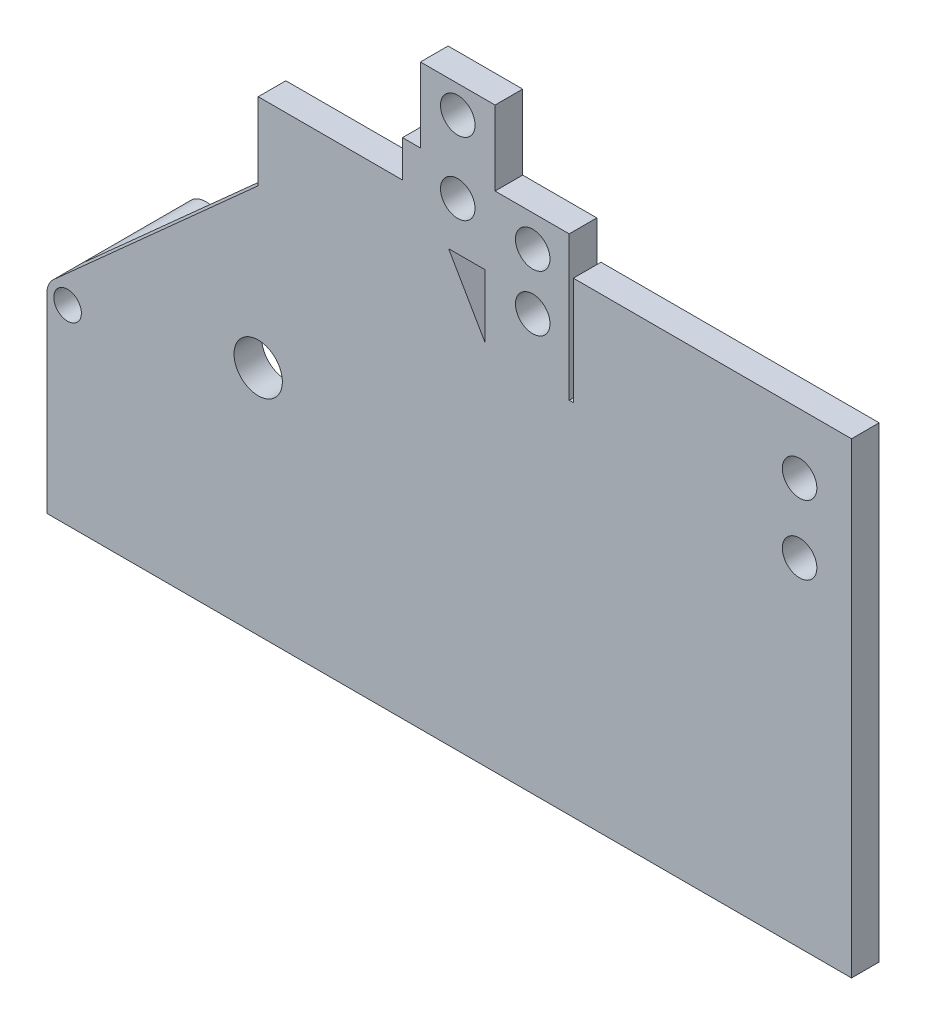
ISO-10303-21;
HEADER;
FILE_DESCRIPTION(('STEP AP214'),'2;1');
FILE_NAME('part.step','',(''),(''),'','','');
FILE_SCHEMA(('AUTOMOTIVE_DESIGN { 1 0 10303 214 1 1 1 1 }'));
ENDSEC;
DATA;
#1=APPLICATION_CONTEXT('core data for automotive mechanical design processes');
#2=APPLICATION_PROTOCOL_DEFINITION('international standard','automotive_design',2000,#1);
#3=PRODUCT_CONTEXT('',#1,'mechanical');
#4=PRODUCT('Part','Part','',(#3));
#5=PRODUCT_RELATED_PRODUCT_CATEGORY('part','',(#4));
#6=PRODUCT_DEFINITION_FORMATION('','',#4);
#7=PRODUCT_DEFINITION_CONTEXT('part definition',#1,'design');
#8=PRODUCT_DEFINITION('design','',#6,#7);
#9=PRODUCT_DEFINITION_SHAPE('','',#8);
#10=(LENGTH_UNIT() NAMED_UNIT(*) SI_UNIT(.MILLI.,.METRE.));
#11=(NAMED_UNIT(*) PLANE_ANGLE_UNIT() SI_UNIT($,.RADIAN.));
#12=(NAMED_UNIT(*) SI_UNIT($,.STERADIAN.) SOLID_ANGLE_UNIT());
#13=UNCERTAINTY_MEASURE_WITH_UNIT(LENGTH_MEASURE(1.E-05),#10,'distance_accuracy_value','');
#14=(GEOMETRIC_REPRESENTATION_CONTEXT(3) GLOBAL_UNCERTAINTY_ASSIGNED_CONTEXT((#13)) GLOBAL_UNIT_ASSIGNED_CONTEXT((#10,
#11,#12)) REPRESENTATION_CONTEXT('',''));
#15=CARTESIAN_POINT('',(0.,0.,0.));
#16=DIRECTION('',(0.,0.,1.));
#17=DIRECTION('',(1.,0.,0.));
#18=AXIS2_PLACEMENT_3D('',#15,#16,#17);
#19=CARTESIAN_POINT('',(0.,311.384042750519,0.));
#20=DIRECTION('',(0.,1.,0.));
#21=DIRECTION('',(0.,0.,1.));
#22=AXIS2_PLACEMENT_3D('',#19,#20,#21);
#23=PLANE('',#22);
#24=DIRECTION('',(0.,0.,1.));
#25=VECTOR('',#24,1.);
#26=CARTESIAN_POINT('',(290.842773547687,311.384042750519,0.));
#27=LINE('',#26,#25);
#28=CARTESIAN_POINT('',(290.842773547687,311.384042750519,0.));
#29=VERTEX_POINT('',#28);
#30=CARTESIAN_POINT('',(290.842773547687,311.384042750519,20.));
#31=VERTEX_POINT('',#30);
#32=EDGE_CURVE('E132',#29,#31,#27,.T.);
#33=ORIENTED_EDGE('',*,*,#32,.F.);
#34=DIRECTION('',(-1.,0.,0.));
#35=VECTOR('',#34,1.);
#36=CARTESIAN_POINT('',(0.,311.384042750519,0.));
#37=LINE('',#36,#35);
#38=CARTESIAN_POINT('',(317.180522157063,311.384042750519,0.));
#39=VERTEX_POINT('',#38);
#40=EDGE_CURVE('E349',#39,#29,#37,.T.);
#41=ORIENTED_EDGE('',*,*,#40,.F.);
#42=DIRECTION('',(0.,0.,1.));
#43=VECTOR('',#42,1.);
#44=CARTESIAN_POINT('',(317.180522157063,311.384042750519,0.));
#45=LINE('',#44,#43);
#46=CARTESIAN_POINT('',(317.180522157063,311.384042750519,20.));
#47=VERTEX_POINT('',#46);
#48=EDGE_CURVE('E116',#39,#47,#45,.T.);
#49=ORIENTED_EDGE('',*,*,#48,.T.);
#50=DIRECTION('',(-1.,0.,0.));
#51=VECTOR('',#50,1.);
#52=CARTESIAN_POINT('',(0.,311.384042750519,20.));
#53=LINE('',#52,#51);
#54=EDGE_CURVE('E382',#47,#31,#53,.T.);
#55=ORIENTED_EDGE('',*,*,#54,.T.);
#56=EDGE_LOOP('',(#33,#41,#49,#55));
#57=FACE_BOUND('',#56,.T.);
#58=ADVANCED_FACE('F107',(#57),#23,.F.);
#59=CARTESIAN_POINT('',(257.46049576549,0.,0.));
#60=DIRECTION('',(-1.,0.,0.));
#61=DIRECTION('',(0.,0.,1.));
#62=AXIS2_PLACEMENT_3D('',#59,#60,#61);
#63=PLANE('',#62);
#64=DIRECTION('',(0.,-1.,0.));
#65=VECTOR('',#64,1.);
#66=CARTESIAN_POINT('',(257.46049576549,0.,0.));
#67=LINE('',#66,#65);
#68=CARTESIAN_POINT('',(257.46049576549,364.320187298071,0.));
#69=VERTEX_POINT('',#68);
#70=CARTESIAN_POINT('',(257.46049576549,337.740187298071,0.));
#71=VERTEX_POINT('',#70);
#72=EDGE_CURVE('E124',#69,#71,#67,.T.);
#73=ORIENTED_EDGE('',*,*,#72,.T.);
#74=DIRECTION('',(0.,0.,1.));
#75=VECTOR('',#74,1.);
#76=CARTESIAN_POINT('',(257.46049576549,337.740187298071,0.));
#77=LINE('',#76,#75);
#78=CARTESIAN_POINT('',(257.46049576549,337.740187298071,20.));
#79=VERTEX_POINT('',#78);
#80=EDGE_CURVE('E252',#71,#79,#77,.T.);
#81=ORIENTED_EDGE('',*,*,#80,.T.);
#82=DIRECTION('',(0.,-1.,0.));
#83=VECTOR('',#82,1.);
#84=CARTESIAN_POINT('',(257.46049576549,0.,20.));
#85=LINE('',#84,#83);
#86=CARTESIAN_POINT('',(257.46049576549,364.320187298071,20.));
#87=VERTEX_POINT('',#86);
#88=EDGE_CURVE('E379',#87,#79,#85,.T.);
#89=ORIENTED_EDGE('',*,*,#88,.F.);
#90=DIRECTION('',(0.,0.,1.));
#91=VECTOR('',#90,1.);
#92=CARTESIAN_POINT('',(257.46049576549,364.320187298071,0.));
#93=LINE('',#92,#91);
#94=EDGE_CURVE('E399',#69,#87,#93,.T.);
#95=ORIENTED_EDGE('',*,*,#94,.F.);
#96=EDGE_LOOP('',(#73,#81,#89,#95));
#97=FACE_BOUND('',#96,.T.);
#98=ADVANCED_FACE('F444',(#97),#63,.T.);
#99=CARTESIAN_POINT('',(317.180522157063,0.,0.));
#100=DIRECTION('',(1.,0.,0.));
#101=DIRECTION('',(0.,0.,-1.));
#102=AXIS2_PLACEMENT_3D('',#99,#100,#101);
#103=PLANE('',#102);
#104=DIRECTION('',(0.,1.,0.));
#105=VECTOR('',#104,1.);
#106=CARTESIAN_POINT('',(317.180522157063,0.,20.));
#107=LINE('',#106,#105);
#108=CARTESIAN_POINT('',(317.180522157063,265.765724002103,20.));
#109=VERTEX_POINT('',#108);
#110=EDGE_CURVE('E384',#109,#47,#107,.T.);
#111=ORIENTED_EDGE('',*,*,#110,.T.);
#112=ORIENTED_EDGE('',*,*,#48,.F.);
#113=DIRECTION('',(0.,1.,0.));
#114=VECTOR('',#113,1.);
#115=CARTESIAN_POINT('',(317.180522157063,0.,0.));
#116=LINE('',#115,#114);
#117=CARTESIAN_POINT('',(317.180522157063,265.765724002103,0.));
#118=VERTEX_POINT('',#117);
#119=EDGE_CURVE('E351',#118,#39,#116,.T.);
#120=ORIENTED_EDGE('',*,*,#119,.F.);
#121=DIRECTION('',(0.,0.,1.));
#122=VECTOR('',#121,1.);
#123=CARTESIAN_POINT('',(317.180522157063,265.765724002103,0.));
#124=LINE('',#123,#122);
#125=EDGE_CURVE('E12',#118,#109,#124,.T.);
#126=ORIENTED_EDGE('',*,*,#125,.T.);
#127=EDGE_LOOP('',(#111,#112,#120,#126));
#128=FACE_BOUND('',#127,.T.);
#129=ADVANCED_FACE('F449',(#128),#103,.F.);
#130=CARTESIAN_POINT('',(0.,364.320187298071,0.));
#131=DIRECTION('',(0.,-1.,0.));
#132=DIRECTION('',(0.,0.,-1.));
#133=AXIS2_PLACEMENT_3D('',#130,#131,#132);
#134=PLANE('',#133);
#135=DIRECTION('',(1.,0.,0.));
#136=VECTOR('',#135,1.);
#137=CARTESIAN_POINT('',(0.,364.320187298071,20.));
#138=LINE('',#137,#136);
#139=CARTESIAN_POINT('',(270.46049576549,364.320187298071,20.));
#140=VERTEX_POINT('',#139);
#141=EDGE_CURVE('E377',#87,#140,#138,.T.);
#142=ORIENTED_EDGE('',*,*,#141,.T.);
#143=DIRECTION('',(0.,0.,1.));
#144=VECTOR('',#143,1.);
#145=CARTESIAN_POINT('',(270.46049576549,364.320187298071,0.));
#146=LINE('',#145,#144);
#147=CARTESIAN_POINT('',(270.46049576549,364.320187298071,0.));
#148=VERTEX_POINT('',#147);
#149=EDGE_CURVE('E401',#148,#140,#146,.T.);
#150=ORIENTED_EDGE('',*,*,#149,.F.);
#151=DIRECTION('',(1.,0.,0.));
#152=VECTOR('',#151,1.);
#153=CARTESIAN_POINT('',(0.,364.320187298071,0.));
#154=LINE('',#153,#152);
#155=EDGE_CURVE('E346',#69,#148,#154,.T.);
#156=ORIENTED_EDGE('',*,*,#155,.F.);
#157=ORIENTED_EDGE('',*,*,#94,.T.);
#158=EDGE_LOOP('',(#142,#150,#156,#157));
#159=FACE_BOUND('',#158,.T.);
#160=ADVANCED_FACE('F453',(#159),#134,.F.);
#161=CARTESIAN_POINT('',(270.46049576549,0.,0.));
#162=DIRECTION('',(1.,0.,0.));
#163=DIRECTION('',(0.,0.,-1.));
#164=AXIS2_PLACEMENT_3D('',#161,#162,#163);
#165=PLANE('',#164);
#166=DIRECTION('',(0.,1.,0.));
#167=VECTOR('',#166,1.);
#168=CARTESIAN_POINT('',(270.46049576549,0.,20.));
#169=LINE('',#168,#167);
#170=CARTESIAN_POINT('',(270.46049576549,418.251615442449,20.));
#171=VERTEX_POINT('',#170);
#172=EDGE_CURVE('E375',#140,#171,#169,.T.);
#173=ORIENTED_EDGE('',*,*,#172,.T.);
#174=DIRECTION('',(0.,0.,1.));
#175=VECTOR('',#174,1.);
#176=CARTESIAN_POINT('',(270.46049576549,418.251615442449,0.));
#177=LINE('',#176,#175);
#178=CARTESIAN_POINT('',(270.46049576549,418.251615442449,0.));
#179=VERTEX_POINT('',#178);
#180=EDGE_CURVE('E404',#179,#171,#177,.T.);
#181=ORIENTED_EDGE('',*,*,#180,.F.);
#182=DIRECTION('',(0.,1.,0.));
#183=VECTOR('',#182,1.);
#184=CARTESIAN_POINT('',(270.46049576549,0.,0.));
#185=LINE('',#184,#183);
#186=EDGE_CURVE('E344',#148,#179,#185,.T.);
#187=ORIENTED_EDGE('',*,*,#186,.F.);
#188=ORIENTED_EDGE('',*,*,#149,.T.);
#189=EDGE_LOOP('',(#173,#181,#187,#188));
#190=FACE_BOUND('',#189,.T.);
#191=ADVANCED_FACE('F456',(#190),#165,.F.);
#192=CARTESIAN_POINT('',(0.,418.251615442449,0.));
#193=DIRECTION('',(0.,-1.,0.));
#194=DIRECTION('',(0.,0.,-1.));
#195=AXIS2_PLACEMENT_3D('',#192,#193,#194);
#196=PLANE('',#195);
#197=DIRECTION('',(1.,0.,0.));
#198=VECTOR('',#197,1.);
#199=CARTESIAN_POINT('',(0.,418.251615442449,20.));
#200=LINE('',#199,#198);
#201=CARTESIAN_POINT('',(324.46049576549,418.251615442449,20.));
#202=VERTEX_POINT('',#201);
#203=EDGE_CURVE('E373',#171,#202,#200,.T.);
#204=ORIENTED_EDGE('',*,*,#203,.T.);
#205=DIRECTION('',(0.,0.,1.));
#206=VECTOR('',#205,1.);
#207=CARTESIAN_POINT('',(324.46049576549,418.251615442449,0.));
#208=LINE('',#207,#206);
#209=CARTESIAN_POINT('',(324.46049576549,418.251615442449,0.));
#210=VERTEX_POINT('',#209);
#211=EDGE_CURVE('E407',#210,#202,#208,.T.);
#212=ORIENTED_EDGE('',*,*,#211,.F.);
#213=DIRECTION('',(1.,0.,0.));
#214=VECTOR('',#213,1.);
#215=CARTESIAN_POINT('',(0.,418.251615442449,0.));
#216=LINE('',#215,#214);
#217=EDGE_CURVE('E342',#179,#210,#216,.T.);
#218=ORIENTED_EDGE('',*,*,#217,.F.);
#219=ORIENTED_EDGE('',*,*,#180,.T.);
#220=EDGE_LOOP('',(#204,#212,#218,#219));
#221=FACE_BOUND('',#220,.T.);
#222=ADVANCED_FACE('F460',(#221),#196,.F.);
#223=CARTESIAN_POINT('',(324.46049576549,0.,0.));
#224=DIRECTION('',(-1.,0.,0.));
#225=DIRECTION('',(0.,0.,1.));
#226=AXIS2_PLACEMENT_3D('',#223,#224,#225);
#227=PLANE('',#226);
#228=DIRECTION('',(0.,-1.,0.));
#229=VECTOR('',#228,1.);
#230=CARTESIAN_POINT('',(324.46049576549,0.,20.));
#231=LINE('',#230,#229);
#232=CARTESIAN_POINT('',(324.46049576549,364.320187298071,20.));
#233=VERTEX_POINT('',#232);
#234=EDGE_CURVE('E370',#202,#233,#231,.T.);
#235=ORIENTED_EDGE('',*,*,#234,.T.);
#236=DIRECTION('',(0.,0.,1.));
#237=VECTOR('',#236,1.);
#238=CARTESIAN_POINT('',(324.46049576549,364.320187298071,0.));
#239=LINE('',#238,#237);
#240=CARTESIAN_POINT('',(324.46049576549,364.320187298071,0.));
#241=VERTEX_POINT('',#240);
#242=EDGE_CURVE('E410',#241,#233,#239,.T.);
#243=ORIENTED_EDGE('',*,*,#242,.F.);
#244=DIRECTION('',(0.,-1.,0.));
#245=VECTOR('',#244,1.);
#246=CARTESIAN_POINT('',(324.46049576549,0.,0.));
#247=LINE('',#246,#245);
#248=EDGE_CURVE('E340',#210,#241,#247,.T.);
#249=ORIENTED_EDGE('',*,*,#248,.F.);
#250=ORIENTED_EDGE('',*,*,#211,.T.);
#251=EDGE_LOOP('',(#235,#243,#249,#250));
#252=FACE_BOUND('',#251,.T.);
#253=ADVANCED_FACE('F464',(#252),#227,.F.);
#254=CARTESIAN_POINT('',(0.,364.320187298071,0.));
#255=DIRECTION('',(0.,1.,0.));
#256=DIRECTION('',(0.,0.,1.));
#257=AXIS2_PLACEMENT_3D('',#254,#255,#256);
#258=PLANE('',#257);
#259=DIRECTION('',(-1.,0.,0.));
#260=VECTOR('',#259,1.);
#261=CARTESIAN_POINT('',(0.,364.320187298071,20.));
#262=LINE('',#261,#260);
#263=CARTESIAN_POINT('',(378.12049576549,364.320187298071,20.));
#264=VERTEX_POINT('',#263);
#265=EDGE_CURVE('E367',#264,#233,#262,.T.);
#266=ORIENTED_EDGE('',*,*,#265,.F.);
#267=DIRECTION('',(0.,0.,1.));
#268=VECTOR('',#267,1.);
#269=CARTESIAN_POINT('',(378.12049576549,364.320187298071,0.));
#270=LINE('',#269,#268);
#271=CARTESIAN_POINT('',(378.12049576549,364.320187298071,0.));
#272=VERTEX_POINT('',#271);
#273=EDGE_CURVE('E411',#272,#264,#270,.T.);
#274=ORIENTED_EDGE('',*,*,#273,.F.);
#275=DIRECTION('',(-1.,0.,0.));
#276=VECTOR('',#275,1.);
#277=CARTESIAN_POINT('',(0.,364.320187298071,0.));
#278=LINE('',#277,#276);
#279=EDGE_CURVE('E336',#272,#241,#278,.T.);
#280=ORIENTED_EDGE('',*,*,#279,.T.);
#281=ORIENTED_EDGE('',*,*,#242,.T.);
#282=EDGE_LOOP('',(#266,#274,#280,#281));
#283=FACE_BOUND('',#282,.T.);
#284=ADVANCED_FACE('F467',(#283),#258,.T.);
#285=CARTESIAN_POINT('',(297.46049576549,346.134042750519,0.));
#286=DIRECTION('',(0.,0.,1.));
#287=DIRECTION('',(1.,0.,0.));
#288=AXIS2_PLACEMENT_3D('',#285,#286,#287);
#289=CYLINDRICAL_SURFACE('',#288,12.5);
#290=CARTESIAN_POINT('',(297.46049576549,346.134042750519,0.));
#291=DIRECTION('',(0.,0.,1.));
#292=DIRECTION('',(1.,0.,0.));
#293=AXIS2_PLACEMENT_3D('',#290,#291,#292);
#294=CIRCLE('',#293,12.5);
#295=CARTESIAN_POINT('',(309.96049576549,346.134042750519,0.));
#296=VERTEX_POINT('',#295);
#297=EDGE_CURVE('E359',#296,#296,#294,.T.);
#298=ORIENTED_EDGE('',*,*,#297,.F.);
#299=EDGE_LOOP('',(#298));
#300=FACE_BOUND('',#299,.T.);
#301=CARTESIAN_POINT('',(297.46049576549,346.134042750519,20.));
#302=DIRECTION('',(0.,0.,1.));
#303=DIRECTION('',(1.,0.,0.));
#304=AXIS2_PLACEMENT_3D('',#301,#302,#303);
#305=CIRCLE('',#304,12.5);
#306=CARTESIAN_POINT('',(309.96049576549,346.134042750519,20.));
#307=VERTEX_POINT('',#306);
#308=EDGE_CURVE('E392',#307,#307,#305,.T.);
#309=ORIENTED_EDGE('',*,*,#308,.T.);
#310=EDGE_LOOP('',(#309));
#311=FACE_BOUND('',#310,.T.);
#312=ADVANCED_FACE('F470',(#300,#311),#289,.F.);
#313=CARTESIAN_POINT('',(351.71049576549,341.56,0.));
#314=DIRECTION('',(0.,0.,1.));
#315=DIRECTION('',(1.,0.,0.));
#316=AXIS2_PLACEMENT_3D('',#313,#314,#315);
#317=CYLINDRICAL_SURFACE('',#316,12.5);
#318=CARTESIAN_POINT('',(351.71049576549,341.56,0.));
#319=DIRECTION('',(0.,0.,1.));
#320=DIRECTION('',(1.,0.,0.));
#321=AXIS2_PLACEMENT_3D('',#318,#319,#320);
#322=CIRCLE('',#321,12.5);
#323=CARTESIAN_POINT('',(364.21049576549,341.56,0.));
#324=VERTEX_POINT('',#323);
#325=EDGE_CURVE('E356',#324,#324,#322,.T.);
#326=ORIENTED_EDGE('',*,*,#325,.F.);
#327=EDGE_LOOP('',(#326));
#328=FACE_BOUND('',#327,.T.);
#329=CARTESIAN_POINT('',(351.71049576549,341.56,20.));
#330=DIRECTION('',(0.,0.,1.));
#331=DIRECTION('',(1.,0.,0.));
#332=AXIS2_PLACEMENT_3D('',#329,#330,#331);
#333=CIRCLE('',#332,12.5);
#334=CARTESIAN_POINT('',(364.21049576549,341.56,20.));
#335=VERTEX_POINT('',#334);
#336=EDGE_CURVE('E389',#335,#335,#333,.T.);
#337=ORIENTED_EDGE('',*,*,#336,.T.);
#338=EDGE_LOOP('',(#337));
#339=FACE_BOUND('',#338,.T.);
#340=ADVANCED_FACE('F440',(#328,#339),#317,.F.);
#341=CARTESIAN_POINT('',(297.46049576549,398.384042750519,0.));
#342=DIRECTION('',(0.,0.,1.));
#343=DIRECTION('',(1.,0.,0.));
#344=AXIS2_PLACEMENT_3D('',#341,#342,#343);
#345=CYLINDRICAL_SURFACE('',#344,12.5);
#346=CARTESIAN_POINT('',(297.46049576549,398.384042750519,0.));
#347=DIRECTION('',(0.,0.,1.));
#348=DIRECTION('',(1.,0.,0.));
#349=AXIS2_PLACEMENT_3D('',#346,#347,#348);
#350=CIRCLE('',#349,12.5);
#351=CARTESIAN_POINT('',(309.96049576549,398.384042750519,0.));
#352=VERTEX_POINT('',#351);
#353=EDGE_CURVE('E353',#352,#352,#350,.T.);
#354=ORIENTED_EDGE('',*,*,#353,.F.);
#355=EDGE_LOOP('',(#354));
#356=FACE_BOUND('',#355,.T.);
#357=CARTESIAN_POINT('',(297.46049576549,398.384042750519,20.));
#358=DIRECTION('',(0.,0.,1.));
#359=DIRECTION('',(1.,0.,0.));
#360=AXIS2_PLACEMENT_3D('',#357,#358,#359);
#361=CIRCLE('',#360,12.5);
#362=CARTESIAN_POINT('',(309.96049576549,398.384042750519,20.));
#363=VERTEX_POINT('',#362);
#364=EDGE_CURVE('E386',#363,#363,#361,.T.);
#365=ORIENTED_EDGE('',*,*,#364,.T.);
#366=EDGE_LOOP('',(#365));
#367=FACE_BOUND('',#366,.T.);
#368=ADVANCED_FACE('F433',(#356,#367),#345,.F.);
#369=CARTESIAN_POINT('',(378.12049576549,0.,0.));
#370=DIRECTION('',(1.,0.,0.));
#371=DIRECTION('',(0.,0.,-1.));
#372=AXIS2_PLACEMENT_3D('',#369,#370,#371);
#373=PLANE('',#372);
#374=DIRECTION('',(0.,1.,0.));
#375=VECTOR('',#374,1.);
#376=CARTESIAN_POINT('',(378.12049576549,0.,20.));
#377=LINE('',#376,#375);
#378=CARTESIAN_POINT('',(378.12049576549,260.,20.));
#379=VERTEX_POINT('',#378);
#380=EDGE_CURVE('E327',#379,#264,#377,.T.);
#381=ORIENTED_EDGE('',*,*,#380,.F.);
#382=DIRECTION('',(0.,0.,1.));
#383=VECTOR('',#382,1.);
#384=CARTESIAN_POINT('',(378.12049576549,260.,0.));
#385=LINE('',#384,#383);
#386=CARTESIAN_POINT('',(378.12049576549,260.,0.));
#387=VERTEX_POINT('',#386);
#388=EDGE_CURVE('E111',#387,#379,#385,.T.);
#389=ORIENTED_EDGE('',*,*,#388,.F.);
#390=DIRECTION('',(0.,1.,0.));
#391=VECTOR('',#390,1.);
#392=CARTESIAN_POINT('',(378.12049576549,0.,0.));
#393=LINE('',#392,#391);
#394=EDGE_CURVE('E333',#387,#272,#393,.T.);
#395=ORIENTED_EDGE('',*,*,#394,.T.);
#396=ORIENTED_EDGE('',*,*,#273,.T.);
#397=EDGE_LOOP('',(#381,#389,#395,#396));
#398=FACE_BOUND('',#397,.T.);
#399=ADVANCED_FACE('F109',(#398),#373,.T.);
#400=CARTESIAN_POINT('',(351.71049576549,301.,0.));
#401=DIRECTION('',(0.,0.,1.));
#402=DIRECTION('',(1.,0.,0.));
#403=AXIS2_PLACEMENT_3D('',#400,#401,#402);
#404=CYLINDRICAL_SURFACE('',#403,12.5);
#405=CARTESIAN_POINT('',(351.71049576549,301.,0.));
#406=DIRECTION('',(0.,0.,1.));
#407=DIRECTION('',(1.,0.,0.));
#408=AXIS2_PLACEMENT_3D('',#405,#406,#407);
#409=CIRCLE('',#408,12.5);
#410=CARTESIAN_POINT('',(364.21049576549,301.,0.));
#411=VERTEX_POINT('',#410);
#412=EDGE_CURVE('E362',#411,#411,#409,.T.);
#413=ORIENTED_EDGE('',*,*,#412,.F.);
#414=EDGE_LOOP('',(#413));
#415=FACE_BOUND('',#414,.T.);
#416=CARTESIAN_POINT('',(351.71049576549,301.,20.));
#417=DIRECTION('',(0.,0.,1.));
#418=DIRECTION('',(1.,0.,0.));
#419=AXIS2_PLACEMENT_3D('',#416,#417,#418);
#420=CIRCLE('',#419,12.5);
#421=CARTESIAN_POINT('',(364.21049576549,301.,20.));
#422=VERTEX_POINT('',#421);
#423=EDGE_CURVE('E337',#422,#422,#420,.T.);
#424=ORIENTED_EDGE('',*,*,#423,.T.);
#425=EDGE_LOOP('',(#424));
#426=FACE_BOUND('',#425,.T.);
#427=ADVANCED_FACE('F432',(#415,#426),#404,.F.);
#428=CARTESIAN_POINT('',(0.,0.,0.));
#429=DIRECTION('',(0.,0.,1.));
#430=DIRECTION('',(1.,0.,0.));
#431=AXIS2_PLACEMENT_3D('',#428,#429,#430);
#432=PLANE('',#431);
#433=CARTESIAN_POINT('',(544.895661023303,294.516190979496,0.));
#434=DIRECTION('',(0.,0.,1.));
#435=DIRECTION('',(1.,0.,0.));
#436=AXIS2_PLACEMENT_3D('',#433,#434,#435);
#437=CIRCLE('',#436,12.5);
#438=CARTESIAN_POINT('',(557.395661023303,294.516190979496,0.));
#439=VERTEX_POINT('',#438);
#440=EDGE_CURVE('E593',#439,#439,#437,.T.);
#441=ORIENTED_EDGE('',*,*,#440,.T.);
#442=EDGE_LOOP('',(#441));
#443=FACE_BOUND('',#442,.T.);
#444=CARTESIAN_POINT('',(544.895661023303,244.516190979496,0.));
#445=DIRECTION('',(0.,0.,1.));
#446=DIRECTION('',(1.,0.,0.));
#447=AXIS2_PLACEMENT_3D('',#444,#445,#446);
#448=CIRCLE('',#447,12.5);
#449=CARTESIAN_POINT('',(557.395661023303,244.516190979496,0.));
#450=VERTEX_POINT('',#449);
#451=EDGE_CURVE('E603',#450,#450,#448,.T.);
#452=ORIENTED_EDGE('',*,*,#451,.T.);
#453=EDGE_LOOP('',(#452));
#454=FACE_BOUND('',#453,.T.);
#455=DIRECTION('',(1.,0.,0.));
#456=VECTOR('',#455,1.);
#457=CARTESIAN_POINT('',(0.,337.740187298071,0.));
#458=LINE('',#457,#456);
#459=CARTESIAN_POINT('',(153.,337.740187298071,0.));
#460=VERTEX_POINT('',#459);
#461=EDGE_CURVE('E246',#460,#71,#458,.T.);
#462=ORIENTED_EDGE('',*,*,#461,.T.);
#463=ORIENTED_EDGE('',*,*,#72,.F.);
#464=ORIENTED_EDGE('',*,*,#155,.T.);
#465=ORIENTED_EDGE('',*,*,#186,.T.);
#466=ORIENTED_EDGE('',*,*,#217,.T.);
#467=ORIENTED_EDGE('',*,*,#248,.T.);
#468=ORIENTED_EDGE('',*,*,#279,.F.);
#469=ORIENTED_EDGE('',*,*,#394,.F.);
#470=DIRECTION('',(1.,0.,0.));
#471=VECTOR('',#470,1.);
#472=CARTESIAN_POINT('',(381.119364461751,260.,0.));
#473=LINE('',#472,#471);
#474=CARTESIAN_POINT('',(381.119364461751,260.,0.));
#475=VERTEX_POINT('',#474);
#476=EDGE_CURVE('E265',#387,#475,#473,.T.);
#477=ORIENTED_EDGE('',*,*,#476,.T.);
#478=DIRECTION('',(0.,1.,0.));
#479=VECTOR('',#478,1.);
#480=CARTESIAN_POINT('',(381.119364461751,260.,0.));
#481=LINE('',#480,#479);
#482=CARTESIAN_POINT('',(381.119364461751,338.045557153582,0.));
#483=VERTEX_POINT('',#482);
#484=EDGE_CURVE('E318',#475,#483,#481,.T.);
#485=ORIENTED_EDGE('',*,*,#484,.T.);
#486=DIRECTION('',(1.,0.,0.));
#487=VECTOR('',#486,1.);
#488=CARTESIAN_POINT('',(522.5,338.045557153582,0.));
#489=LINE('',#488,#487);
#490=CARTESIAN_POINT('',(582.5,338.045557153582,0.));
#491=VERTEX_POINT('',#490);
#492=EDGE_CURVE('E321',#483,#491,#489,.T.);
#493=ORIENTED_EDGE('',*,*,#492,.T.);
#494=DIRECTION('',(0.,-1.,0.));
#495=VECTOR('',#494,1.);
#496=CARTESIAN_POINT('',(582.5,338.045557153582,0.));
#497=LINE('',#496,#495);
#498=CARTESIAN_POINT('',(582.5,0.,0.));
#499=VERTEX_POINT('',#498);
#500=EDGE_CURVE('E309',#491,#499,#497,.T.);
#501=ORIENTED_EDGE('',*,*,#500,.T.);
#502=DIRECTION('',(1.,0.,0.));
#503=VECTOR('',#502,1.);
#504=CARTESIAN_POINT('',(0.,0.,0.));
#505=LINE('',#504,#503);
#506=CARTESIAN_POINT('',(0.,0.,0.));
#507=VERTEX_POINT('',#506);
#508=EDGE_CURVE('E283',#507,#499,#505,.T.);
#509=ORIENTED_EDGE('',*,*,#508,.F.);
#510=DIRECTION('',(0.,1.,0.));
#511=VECTOR('',#510,1.);
#512=CARTESIAN_POINT('',(0.,0.,0.));
#513=LINE('',#512,#511);
#514=CARTESIAN_POINT('',(0.,138.,0.));
#515=VERTEX_POINT('',#514);
#516=EDGE_CURVE('E274',#507,#515,#513,.T.);
#517=ORIENTED_EDGE('',*,*,#516,.T.);
#518=CARTESIAN_POINT('',(15.,138.,0.));
#519=DIRECTION('',(0.,0.,1.));
#520=DIRECTION('',(1.,0.,0.));
#521=AXIS2_PLACEMENT_3D('',#518,#519,#520);
#522=CIRCLE('',#521,15.);
#523=CARTESIAN_POINT('',(4.98478225609769,149.16671005902,0.));
#524=VERTEX_POINT('',#523);
#525=EDGE_CURVE('E303',#515,#524,#522,.T.);
#526=ORIENTED_EDGE('',*,*,#525,.T.);
#527=DIRECTION('',(0.744447337268019,0.66768118292682,0.));
#528=VECTOR('',#527,1.);
#529=CARTESIAN_POINT('',(-71.9216253841728,80.190761516644,0.));
#530=LINE('',#529,#528);
#531=CARTESIAN_POINT('',(153.,281.918848090833,0.));
#532=VERTEX_POINT('',#531);
#533=EDGE_CURVE('E271',#524,#532,#530,.T.);
#534=ORIENTED_EDGE('',*,*,#533,.T.);
#535=DIRECTION('',(0.,1.,0.));
#536=VECTOR('',#535,1.);
#537=CARTESIAN_POINT('',(153.,0.,0.));
#538=LINE('',#537,#536);
#539=EDGE_CURVE('E261',#532,#460,#538,.T.);
#540=ORIENTED_EDGE('',*,*,#539,.T.);
#541=EDGE_LOOP('',(#462,#463,#464,#465,#466,#467,#468,#469,#477,#485,#493,#501,#509,#517,#526,
#534,#540));
#542=FACE_BOUND('',#541,.T.);
#543=ORIENTED_EDGE('',*,*,#40,.T.);
#544=DIRECTION('',(0.5,-0.866025403784438,0.));
#545=VECTOR('',#544,1.);
#546=CARTESIAN_POINT('',(352.96532583829,203.784625887341,0.));
#547=LINE('',#546,#545);
#548=EDGE_CURVE('E255',#29,#118,#547,.T.);
#549=ORIENTED_EDGE('',*,*,#548,.T.);
#550=ORIENTED_EDGE('',*,*,#119,.T.);
#551=EDGE_LOOP('',(#543,#549,#550));
#552=FACE_BOUND('',#551,.T.);
#553=ORIENTED_EDGE('',*,*,#353,.T.);
#554=EDGE_LOOP('',(#553));
#555=FACE_BOUND('',#554,.T.);
#556=ORIENTED_EDGE('',*,*,#325,.T.);
#557=EDGE_LOOP('',(#556));
#558=FACE_BOUND('',#557,.T.);
#559=ORIENTED_EDGE('',*,*,#297,.T.);
#560=EDGE_LOOP('',(#559));
#561=FACE_BOUND('',#560,.T.);
#562=ORIENTED_EDGE('',*,*,#412,.T.);
#563=EDGE_LOOP('',(#562));
#564=FACE_BOUND('',#563,.T.);
#565=CARTESIAN_POINT('',(153.,167.740187298071,0.));
#566=DIRECTION('',(0.,0.,1.));
#567=DIRECTION('',(1.,0.,0.));
#568=AXIS2_PLACEMENT_3D('',#565,#566,#567);
#569=CIRCLE('',#568,17.5);
#570=CARTESIAN_POINT('',(170.5,167.740187298071,0.));
#571=VERTEX_POINT('',#570);
#572=EDGE_CURVE('E272',#571,#571,#569,.T.);
#573=ORIENTED_EDGE('',*,*,#572,.T.);
#574=EDGE_LOOP('',(#573));
#575=FACE_BOUND('',#574,.T.);
#576=ADVANCED_FACE('F268',(#443,#454,#542,#552,#555,#558,#561,#564,#575),#432,.F.);
#577=CARTESIAN_POINT('',(0.,0.,20.));
#578=DIRECTION('',(0.,0.,1.));
#579=DIRECTION('',(1.,0.,0.));
#580=AXIS2_PLACEMENT_3D('',#577,#578,#579);
#581=PLANE('',#580);
#582=CARTESIAN_POINT('',(544.895661023303,294.516190979496,20.));
#583=DIRECTION('',(0.,0.,1.));
#584=DIRECTION('',(1.,0.,0.));
#585=AXIS2_PLACEMENT_3D('',#582,#583,#584);
#586=CIRCLE('',#585,12.5);
#587=CARTESIAN_POINT('',(557.395661023303,294.516190979496,20.));
#588=VERTEX_POINT('',#587);
#589=EDGE_CURVE('E597',#588,#588,#586,.T.);
#590=ORIENTED_EDGE('',*,*,#589,.F.);
#591=EDGE_LOOP('',(#590));
#592=FACE_BOUND('',#591,.T.);
#593=CARTESIAN_POINT('',(544.895661023303,244.516190979496,20.));
#594=DIRECTION('',(0.,0.,1.));
#595=DIRECTION('',(1.,0.,0.));
#596=AXIS2_PLACEMENT_3D('',#593,#594,#595);
#597=CIRCLE('',#596,12.5);
#598=CARTESIAN_POINT('',(557.395661023303,244.516190979496,20.));
#599=VERTEX_POINT('',#598);
#600=EDGE_CURVE('E600',#599,#599,#597,.T.);
#601=ORIENTED_EDGE('',*,*,#600,.F.);
#602=EDGE_LOOP('',(#601));
#603=FACE_BOUND('',#602,.T.);
#604=ORIENTED_EDGE('',*,*,#88,.T.);
#605=DIRECTION('',(1.,0.,0.));
#606=VECTOR('',#605,1.);
#607=CARTESIAN_POINT('',(0.,337.740187298071,20.));
#608=LINE('',#607,#606);
#609=CARTESIAN_POINT('',(153.,337.740187298071,20.));
#610=VERTEX_POINT('',#609);
#611=EDGE_CURVE('E592',#610,#79,#608,.T.);
#612=ORIENTED_EDGE('',*,*,#611,.F.);
#613=DIRECTION('',(0.,1.,0.));
#614=VECTOR('',#613,1.);
#615=CARTESIAN_POINT('',(153.,0.,20.));
#616=LINE('',#615,#614);
#617=CARTESIAN_POINT('',(153.,281.918848090833,20.));
#618=VERTEX_POINT('',#617);
#619=EDGE_CURVE('E264',#618,#610,#616,.T.);
#620=ORIENTED_EDGE('',*,*,#619,.F.);
#621=DIRECTION('',(0.744447337268019,0.66768118292682,0.));
#622=VECTOR('',#621,1.);
#623=CARTESIAN_POINT('',(-71.9216253841728,80.190761516644,20.));
#624=LINE('',#623,#622);
#625=CARTESIAN_POINT('',(4.98478225609769,149.16671005902,20.));
#626=VERTEX_POINT('',#625);
#627=EDGE_CURVE('E506',#626,#618,#624,.T.);
#628=ORIENTED_EDGE('',*,*,#627,.F.);
#629=CARTESIAN_POINT('',(15.,138.,20.));
#630=DIRECTION('',(0.,0.,1.));
#631=DIRECTION('',(1.,0.,0.));
#632=AXIS2_PLACEMENT_3D('',#629,#630,#631);
#633=CIRCLE('',#632,15.);
#634=CARTESIAN_POINT('',(0.,138.,20.));
#635=VERTEX_POINT('',#634);
#636=EDGE_CURVE('E277',#626,#635,#633,.T.);
#637=ORIENTED_EDGE('',*,*,#636,.T.);
#638=DIRECTION('',(0.,1.,0.));
#639=VECTOR('',#638,1.);
#640=CARTESIAN_POINT('',(0.,0.,20.));
#641=LINE('',#640,#639);
#642=CARTESIAN_POINT('',(0.,0.,20.));
#643=VERTEX_POINT('',#642);
#644=EDGE_CURVE('E509',#643,#635,#641,.T.);
#645=ORIENTED_EDGE('',*,*,#644,.F.);
#646=DIRECTION('',(1.,0.,0.));
#647=VECTOR('',#646,1.);
#648=CARTESIAN_POINT('',(0.,0.,20.));
#649=LINE('',#648,#647);
#650=CARTESIAN_POINT('',(582.5,0.,20.));
#651=VERTEX_POINT('',#650);
#652=EDGE_CURVE('E291',#643,#651,#649,.T.);
#653=ORIENTED_EDGE('',*,*,#652,.T.);
#654=DIRECTION('',(0.,-1.,0.));
#655=VECTOR('',#654,1.);
#656=CARTESIAN_POINT('',(582.5,338.045557153582,20.));
#657=LINE('',#656,#655);
#658=CARTESIAN_POINT('',(582.5,338.045557153582,20.));
#659=VERTEX_POINT('',#658);
#660=EDGE_CURVE('E314',#659,#651,#657,.T.);
#661=ORIENTED_EDGE('',*,*,#660,.F.);
#662=DIRECTION('',(1.,0.,0.));
#663=VECTOR('',#662,1.);
#664=CARTESIAN_POINT('',(381.119364461751,338.045557153582,20.));
#665=LINE('',#664,#663);
#666=CARTESIAN_POINT('',(381.119364461751,338.045557153582,20.));
#667=VERTEX_POINT('',#666);
#668=EDGE_CURVE('E312',#667,#659,#665,.T.);
#669=ORIENTED_EDGE('',*,*,#668,.F.);
#670=DIRECTION('',(0.,1.,0.));
#671=VECTOR('',#670,1.);
#672=CARTESIAN_POINT('',(381.119364461751,260.,20.));
#673=LINE('',#672,#671);
#674=CARTESIAN_POINT('',(381.119364461751,260.,20.));
#675=VERTEX_POINT('',#674);
#676=EDGE_CURVE('E308',#675,#667,#673,.T.);
#677=ORIENTED_EDGE('',*,*,#676,.F.);
#678=DIRECTION('',(1.,0.,0.));
#679=VECTOR('',#678,1.);
#680=CARTESIAN_POINT('',(381.119364461751,260.,20.));
#681=LINE('',#680,#679);
#682=EDGE_CURVE('E306',#379,#675,#681,.T.);
#683=ORIENTED_EDGE('',*,*,#682,.F.);
#684=ORIENTED_EDGE('',*,*,#380,.T.);
#685=ORIENTED_EDGE('',*,*,#265,.T.);
#686=ORIENTED_EDGE('',*,*,#234,.F.);
#687=ORIENTED_EDGE('',*,*,#203,.F.);
#688=ORIENTED_EDGE('',*,*,#172,.F.);
#689=ORIENTED_EDGE('',*,*,#141,.F.);
#690=EDGE_LOOP('',(#604,#612,#620,#628,#637,#645,#653,#661,#669,#677,#683,#684,#685,#686,#687,
#688,#689));
#691=FACE_BOUND('',#690,.T.);
#692=ORIENTED_EDGE('',*,*,#110,.F.);
#693=DIRECTION('',(0.5,-0.866025403784438,0.));
#694=VECTOR('',#693,1.);
#695=CARTESIAN_POINT('',(352.96532583829,203.784625887341,20.));
#696=LINE('',#695,#694);
#697=EDGE_CURVE('E256',#31,#109,#696,.T.);
#698=ORIENTED_EDGE('',*,*,#697,.F.);
#699=ORIENTED_EDGE('',*,*,#54,.F.);
#700=EDGE_LOOP('',(#692,#698,#699));
#701=FACE_BOUND('',#700,.T.);
#702=ORIENTED_EDGE('',*,*,#364,.F.);
#703=EDGE_LOOP('',(#702));
#704=FACE_BOUND('',#703,.T.);
#705=ORIENTED_EDGE('',*,*,#336,.F.);
#706=EDGE_LOOP('',(#705));
#707=FACE_BOUND('',#706,.T.);
#708=ORIENTED_EDGE('',*,*,#308,.F.);
#709=EDGE_LOOP('',(#708));
#710=FACE_BOUND('',#709,.T.);
#711=ORIENTED_EDGE('',*,*,#423,.F.);
#712=EDGE_LOOP('',(#711));
#713=FACE_BOUND('',#712,.T.);
#714=CARTESIAN_POINT('',(15.,138.,20.));
#715=DIRECTION('',(0.,0.,1.));
#716=DIRECTION('',(1.,0.,0.));
#717=AXIS2_PLACEMENT_3D('',#714,#715,#716);
#718=CIRCLE('',#717,10.);
#719=CARTESIAN_POINT('',(25.,138.,20.));
#720=VERTEX_POINT('',#719);
#721=EDGE_CURVE('E300',#720,#720,#718,.T.);
#722=ORIENTED_EDGE('',*,*,#721,.F.);
#723=EDGE_LOOP('',(#722));
#724=FACE_BOUND('',#723,.T.);
#725=CARTESIAN_POINT('',(153.,167.740187298071,20.));
#726=DIRECTION('',(0.,0.,1.));
#727=DIRECTION('',(1.,0.,0.));
#728=AXIS2_PLACEMENT_3D('',#725,#726,#727);
#729=CIRCLE('',#728,17.5);
#730=CARTESIAN_POINT('',(170.5,167.740187298071,20.));
#731=VERTEX_POINT('',#730);
#732=EDGE_CURVE('E286',#731,#731,#729,.T.);
#733=ORIENTED_EDGE('',*,*,#732,.F.);
#734=EDGE_LOOP('',(#733));
#735=FACE_BOUND('',#734,.T.);
#736=ADVANCED_FACE('F423',(#592,#603,#691,#701,#704,#707,#710,#713,#724,#735),#581,.T.);
#737=CARTESIAN_POINT('',(381.119364461751,260.,20.));
#738=DIRECTION('',(0.,1.,0.));
#739=DIRECTION('',(0.,0.,1.));
#740=AXIS2_PLACEMENT_3D('',#737,#738,#739);
#741=PLANE('',#740);
#742=ORIENTED_EDGE('',*,*,#476,.F.);
#743=ORIENTED_EDGE('',*,*,#388,.T.);
#744=ORIENTED_EDGE('',*,*,#682,.T.);
#745=DIRECTION('',(0.,0.,-1.));
#746=VECTOR('',#745,1.);
#747=CARTESIAN_POINT('',(381.119364461751,260.,20.));
#748=LINE('',#747,#746);
#749=EDGE_CURVE('E316',#675,#475,#748,.T.);
#750=ORIENTED_EDGE('',*,*,#749,.T.);
#751=EDGE_LOOP('',(#742,#743,#744,#750));
#752=FACE_BOUND('',#751,.T.);
#753=ADVANCED_FACE('F418',(#752),#741,.T.);
#754=CARTESIAN_POINT('',(582.5,338.045557153582,20.));
#755=DIRECTION('',(1.,0.,0.));
#756=DIRECTION('',(0.,0.,-1.));
#757=AXIS2_PLACEMENT_3D('',#754,#755,#756);
#758=PLANE('',#757);
#759=ORIENTED_EDGE('',*,*,#660,.T.);
#760=DIRECTION('',(0.,0.,-1.));
#761=VECTOR('',#760,1.);
#762=CARTESIAN_POINT('',(582.5,0.,20.));
#763=LINE('',#762,#761);
#764=EDGE_CURVE('E287',#651,#499,#763,.T.);
#765=ORIENTED_EDGE('',*,*,#764,.T.);
#766=ORIENTED_EDGE('',*,*,#500,.F.);
#767=DIRECTION('',(0.,0.,-1.));
#768=VECTOR('',#767,1.);
#769=CARTESIAN_POINT('',(582.5,338.045557153582,20.));
#770=LINE('',#769,#768);
#771=EDGE_CURVE('E325',#659,#491,#770,.T.);
#772=ORIENTED_EDGE('',*,*,#771,.F.);
#773=EDGE_LOOP('',(#759,#765,#766,#772));
#774=FACE_BOUND('',#773,.T.);
#775=ADVANCED_FACE('F520',(#774),#758,.T.);
#776=CARTESIAN_POINT('',(522.5,338.045557153582,20.));
#777=DIRECTION('',(0.,1.,0.));
#778=DIRECTION('',(0.,0.,1.));
#779=AXIS2_PLACEMENT_3D('',#776,#777,#778);
#780=PLANE('',#779);
#781=ORIENTED_EDGE('',*,*,#492,.F.);
#782=DIRECTION('',(0.,0.,-1.));
#783=VECTOR('',#782,1.);
#784=CARTESIAN_POINT('',(381.119364461751,338.045557153582,20.));
#785=LINE('',#784,#783);
#786=EDGE_CURVE('E328',#667,#483,#785,.T.);
#787=ORIENTED_EDGE('',*,*,#786,.F.);
#788=ORIENTED_EDGE('',*,*,#668,.T.);
#789=ORIENTED_EDGE('',*,*,#771,.T.);
#790=EDGE_LOOP('',(#781,#787,#788,#789));
#791=FACE_BOUND('',#790,.T.);
#792=ADVANCED_FACE('F523',(#791),#780,.T.);
#793=CARTESIAN_POINT('',(381.119364461751,260.,20.));
#794=DIRECTION('',(-1.,0.,0.));
#795=DIRECTION('',(0.,0.,1.));
#796=AXIS2_PLACEMENT_3D('',#793,#794,#795);
#797=PLANE('',#796);
#798=ORIENTED_EDGE('',*,*,#484,.F.);
#799=ORIENTED_EDGE('',*,*,#749,.F.);
#800=ORIENTED_EDGE('',*,*,#676,.T.);
#801=ORIENTED_EDGE('',*,*,#786,.T.);
#802=EDGE_LOOP('',(#798,#799,#800,#801));
#803=FACE_BOUND('',#802,.T.);
#804=ADVANCED_FACE('F429',(#803),#797,.T.);
#805=CARTESIAN_POINT('',(352.96532583829,203.784625887341,0.));
#806=DIRECTION('',(-0.866025403784438,-0.5,0.));
#807=DIRECTION('',(0.5,-0.866025403784438,0.));
#808=AXIS2_PLACEMENT_3D('',#805,#806,#807);
#809=PLANE('',#808);
#810=ORIENTED_EDGE('',*,*,#697,.T.);
#811=ORIENTED_EDGE('',*,*,#125,.F.);
#812=ORIENTED_EDGE('',*,*,#548,.F.);
#813=ORIENTED_EDGE('',*,*,#32,.T.);
#814=EDGE_LOOP('',(#810,#811,#812,#813));
#815=FACE_BOUND('',#814,.T.);
#816=ADVANCED_FACE('F530',(#815),#809,.F.);
#817=CARTESIAN_POINT('',(153.,0.,20.));
#818=DIRECTION('',(-1.,0.,0.));
#819=DIRECTION('',(0.,0.,1.));
#820=AXIS2_PLACEMENT_3D('',#817,#818,#819);
#821=PLANE('',#820);
#822=ORIENTED_EDGE('',*,*,#539,.F.);
#823=DIRECTION('',(0.,0.,-1.));
#824=VECTOR('',#823,1.);
#825=CARTESIAN_POINT('',(153.,281.918848090833,20.));
#826=LINE('',#825,#824);
#827=EDGE_CURVE('E266',#618,#532,#826,.T.);
#828=ORIENTED_EDGE('',*,*,#827,.F.);
#829=ORIENTED_EDGE('',*,*,#619,.T.);
#830=DIRECTION('',(0.,0.,-1.));
#831=VECTOR('',#830,1.);
#832=CARTESIAN_POINT('',(153.,337.740187298071,20.));
#833=LINE('',#832,#831);
#834=EDGE_CURVE('E250',#610,#460,#833,.T.);
#835=ORIENTED_EDGE('',*,*,#834,.T.);
#836=EDGE_LOOP('',(#822,#828,#829,#835));
#837=FACE_BOUND('',#836,.T.);
#838=ADVANCED_FACE('F260',(#837),#821,.T.);
#839=CARTESIAN_POINT('',(-71.9216253841728,80.190761516644,20.));
#840=DIRECTION('',(-0.66768118292682,0.744447337268019,0.));
#841=DIRECTION('',(-0.744447337268019,-0.66768118292682,0.));
#842=AXIS2_PLACEMENT_3D('',#839,#840,#841);
#843=PLANE('',#842);
#844=ORIENTED_EDGE('',*,*,#533,.F.);
#845=DIRECTION('',(0.,0.,-1.));
#846=VECTOR('',#845,1.);
#847=CARTESIAN_POINT('',(4.98478225609769,149.16671005902,20.));
#848=LINE('',#847,#846);
#849=EDGE_CURVE('E296',#626,#524,#848,.T.);
#850=ORIENTED_EDGE('',*,*,#849,.F.);
#851=ORIENTED_EDGE('',*,*,#627,.T.);
#852=ORIENTED_EDGE('',*,*,#827,.T.);
#853=EDGE_LOOP('',(#844,#850,#851,#852));
#854=FACE_BOUND('',#853,.T.);
#855=ADVANCED_FACE('F591',(#854),#843,.T.);
#856=CARTESIAN_POINT('',(0.,0.,20.));
#857=DIRECTION('',(-1.,0.,0.));
#858=DIRECTION('',(0.,0.,1.));
#859=AXIS2_PLACEMENT_3D('',#856,#857,#858);
#860=PLANE('',#859);
#861=ORIENTED_EDGE('',*,*,#516,.F.);
#862=DIRECTION('',(0.,0.,-1.));
#863=VECTOR('',#862,1.);
#864=CARTESIAN_POINT('',(0.,0.,20.));
#865=LINE('',#864,#863);
#866=EDGE_CURVE('E290',#643,#507,#865,.T.);
#867=ORIENTED_EDGE('',*,*,#866,.F.);
#868=ORIENTED_EDGE('',*,*,#644,.T.);
#869=DIRECTION('',(0.,0.,-1.));
#870=VECTOR('',#869,1.);
#871=CARTESIAN_POINT('',(0.,138.,20.));
#872=LINE('',#871,#870);
#873=EDGE_CURVE('E293',#635,#515,#872,.T.);
#874=ORIENTED_EDGE('',*,*,#873,.T.);
#875=EDGE_LOOP('',(#861,#867,#868,#874));
#876=FACE_BOUND('',#875,.T.);
#877=ADVANCED_FACE('F575',(#876),#860,.T.);
#878=CARTESIAN_POINT('',(0.,0.,20.));
#879=DIRECTION('',(0.,1.,0.));
#880=DIRECTION('',(0.,0.,1.));
#881=AXIS2_PLACEMENT_3D('',#878,#879,#880);
#882=PLANE('',#881);
#883=ORIENTED_EDGE('',*,*,#508,.T.);
#884=ORIENTED_EDGE('',*,*,#764,.F.);
#885=ORIENTED_EDGE('',*,*,#652,.F.);
#886=ORIENTED_EDGE('',*,*,#866,.T.);
#887=EDGE_LOOP('',(#883,#884,#885,#886));
#888=FACE_BOUND('',#887,.T.);
#889=ADVANCED_FACE('F516',(#888),#882,.F.);
#890=CARTESIAN_POINT('',(153.,167.740187298071,20.));
#891=DIRECTION('',(0.,0.,-1.));
#892=DIRECTION('',(-1.,0.,0.));
#893=AXIS2_PLACEMENT_3D('',#890,#891,#892);
#894=CYLINDRICAL_SURFACE('',#893,17.5);
#895=ORIENTED_EDGE('',*,*,#732,.T.);
#896=EDGE_LOOP('',(#895));
#897=FACE_BOUND('',#896,.T.);
#898=ORIENTED_EDGE('',*,*,#572,.F.);
#899=EDGE_LOOP('',(#898));
#900=FACE_BOUND('',#899,.T.);
#901=ADVANCED_FACE('F560',(#897,#900),#894,.F.);
#902=CARTESIAN_POINT('',(15.,138.,20.));
#903=DIRECTION('',(0.,0.,-1.));
#904=DIRECTION('',(-1.,0.,0.));
#905=AXIS2_PLACEMENT_3D('',#902,#903,#904);
#906=CYLINDRICAL_SURFACE('',#905,10.);
#907=ORIENTED_EDGE('',*,*,#721,.T.);
#908=EDGE_LOOP('',(#907));
#909=FACE_BOUND('',#908,.T.);
#910=CARTESIAN_POINT('',(15.,138.,-80.));
#911=DIRECTION('',(0.,0.,1.));
#912=DIRECTION('',(1.,0.,0.));
#913=AXIS2_PLACEMENT_3D('',#910,#911,#912);
#914=CIRCLE('',#913,10.);
#915=CARTESIAN_POINT('',(25.,138.,-80.));
#916=VERTEX_POINT('',#915);
#917=EDGE_CURVE('E491',#916,#916,#914,.T.);
#918=ORIENTED_EDGE('',*,*,#917,.F.);
#919=EDGE_LOOP('',(#918));
#920=FACE_BOUND('',#919,.T.);
#921=ADVANCED_FACE('F563',(#909,#920),#906,.F.);
#922=CARTESIAN_POINT('',(15.,138.,20.));
#923=DIRECTION('',(0.,0.,-1.));
#924=DIRECTION('',(-1.,0.,0.));
#925=AXIS2_PLACEMENT_3D('',#922,#923,#924);
#926=CYLINDRICAL_SURFACE('',#925,15.);
#927=ORIENTED_EDGE('',*,*,#849,.T.);
#928=ORIENTED_EDGE('',*,*,#525,.F.);
#929=ORIENTED_EDGE('',*,*,#873,.F.);
#930=ORIENTED_EDGE('',*,*,#636,.F.);
#931=EDGE_LOOP('',(#927,#928,#929,#930));
#932=FACE_BOUND('',#931,.T.);
#933=CARTESIAN_POINT('',(15.,138.,-80.));
#934=DIRECTION('',(0.,0.,1.));
#935=DIRECTION('',(1.,0.,0.));
#936=AXIS2_PLACEMENT_3D('',#933,#934,#935);
#937=CIRCLE('',#936,15.);
#938=CARTESIAN_POINT('',(30.,138.,-80.));
#939=VERTEX_POINT('',#938);
#940=EDGE_CURVE('E499',#939,#939,#937,.T.);
#941=ORIENTED_EDGE('',*,*,#940,.T.);
#942=EDGE_LOOP('',(#941));
#943=FACE_BOUND('',#942,.T.);
#944=ADVANCED_FACE('F565',(#932,#943),#926,.T.);
#945=CARTESIAN_POINT('',(15.,138.,-80.));
#946=DIRECTION('',(0.,0.,1.));
#947=DIRECTION('',(1.,0.,0.));
#948=AXIS2_PLACEMENT_3D('',#945,#946,#947);
#949=PLANE('',#948);
#950=ORIENTED_EDGE('',*,*,#917,.T.);
#951=EDGE_LOOP('',(#950));
#952=FACE_BOUND('',#951,.T.);
#953=ORIENTED_EDGE('',*,*,#940,.F.);
#954=EDGE_LOOP('',(#953));
#955=FACE_BOUND('',#954,.T.);
#956=ADVANCED_FACE('F574',(#952,#955),#949,.F.);
#957=CARTESIAN_POINT('',(0.,337.740187298071,0.));
#958=DIRECTION('',(0.,-1.,0.));
#959=DIRECTION('',(0.,0.,-1.));
#960=AXIS2_PLACEMENT_3D('',#957,#958,#959);
#961=PLANE('',#960);
#962=ORIENTED_EDGE('',*,*,#611,.T.);
#963=ORIENTED_EDGE('',*,*,#80,.F.);
#964=ORIENTED_EDGE('',*,*,#461,.F.);
#965=ORIENTED_EDGE('',*,*,#834,.F.);
#966=EDGE_LOOP('',(#962,#963,#964,#965));
#967=FACE_BOUND('',#966,.T.);
#968=ADVANCED_FACE('F249',(#967),#961,.F.);
#969=CARTESIAN_POINT('',(544.895661023303,244.516190979496,0.));
#970=DIRECTION('',(0.,0.,1.));
#971=DIRECTION('',(1.,0.,0.));
#972=AXIS2_PLACEMENT_3D('',#969,#970,#971);
#973=CYLINDRICAL_SURFACE('',#972,12.5);
#974=ORIENTED_EDGE('',*,*,#451,.F.);
#975=EDGE_LOOP('',(#974));
#976=FACE_BOUND('',#975,.T.);
#977=ORIENTED_EDGE('',*,*,#600,.T.);
#978=EDGE_LOOP('',(#977));
#979=FACE_BOUND('',#978,.T.);
#980=ADVANCED_FACE('F613',(#976,#979),#973,.F.);
#981=CARTESIAN_POINT('',(544.895661023303,294.516190979496,0.));
#982=DIRECTION('',(0.,0.,1.));
#983=DIRECTION('',(1.,0.,0.));
#984=AXIS2_PLACEMENT_3D('',#981,#982,#983);
#985=CYLINDRICAL_SURFACE('',#984,12.5);
#986=ORIENTED_EDGE('',*,*,#440,.F.);
#987=EDGE_LOOP('',(#986));
#988=FACE_BOUND('',#987,.T.);
#989=ORIENTED_EDGE('',*,*,#589,.T.);
#990=EDGE_LOOP('',(#989));
#991=FACE_BOUND('',#990,.T.);
#992=ADVANCED_FACE('F609',(#988,#991),#985,.F.);
#993=CLOSED_SHELL('',(#58,#98,#129,#160,#191,#222,#253,#284,#312,#340,#368,#399,#427,#576,#736,
#753,#775,#792,#804,#816,#838,#855,#877,#889,#901,#921,#944,#956,#968,#980,#992));
#994=MANIFOLD_SOLID_BREP('B2',#993);
#995=ADVANCED_BREP_SHAPE_REPRESENTATION('',(#18,#994),#14);
#996=SHAPE_DEFINITION_REPRESENTATION(#9,#995);
ENDSEC;
END-ISO-10303-21;
